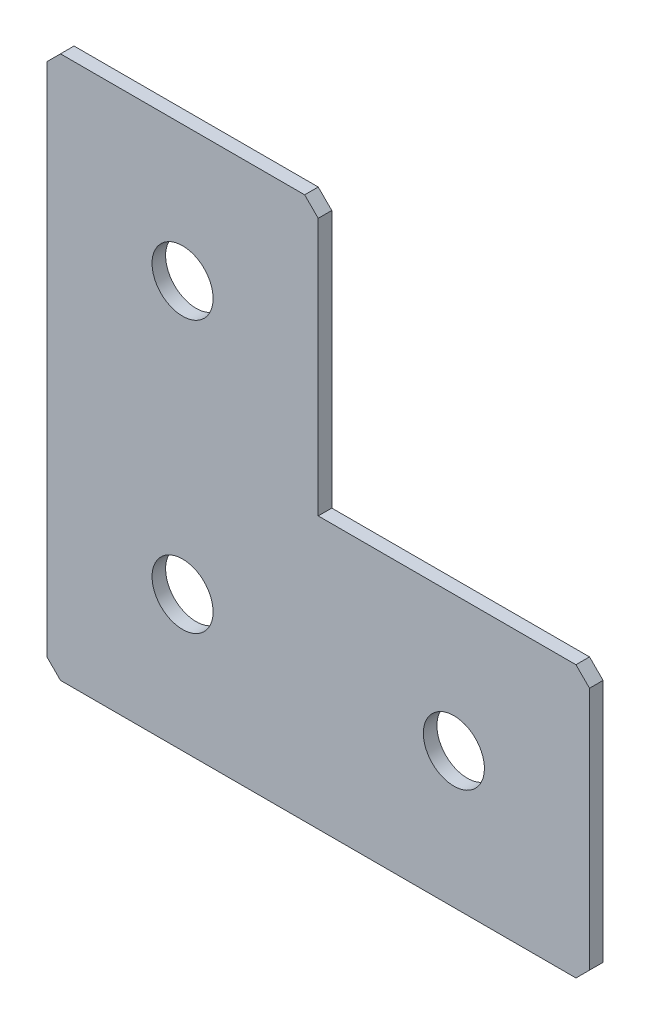
ISO-10303-21;
HEADER;
FILE_DESCRIPTION(('STEP AP214'),'2;1');
FILE_NAME('part.step','',(''),(''),'','','');
FILE_SCHEMA(('AUTOMOTIVE_DESIGN { 1 0 10303 214 1 1 1 1 }'));
ENDSEC;
DATA;
#1=APPLICATION_CONTEXT('core data for automotive mechanical design processes');
#2=APPLICATION_PROTOCOL_DEFINITION('international standard','automotive_design',2000,#1);
#3=PRODUCT_CONTEXT('',#1,'mechanical');
#4=PRODUCT('Part','Part','',(#3));
#5=PRODUCT_RELATED_PRODUCT_CATEGORY('part','',(#4));
#6=PRODUCT_DEFINITION_FORMATION('','',#4);
#7=PRODUCT_DEFINITION_CONTEXT('part definition',#1,'design');
#8=PRODUCT_DEFINITION('design','',#6,#7);
#9=PRODUCT_DEFINITION_SHAPE('','',#8);
#10=(LENGTH_UNIT() NAMED_UNIT(*) SI_UNIT(.MILLI.,.METRE.));
#11=(NAMED_UNIT(*) PLANE_ANGLE_UNIT() SI_UNIT($,.RADIAN.));
#12=(NAMED_UNIT(*) SI_UNIT($,.STERADIAN.) SOLID_ANGLE_UNIT());
#13=UNCERTAINTY_MEASURE_WITH_UNIT(LENGTH_MEASURE(1.E-05),#10,'distance_accuracy_value','');
#14=(GEOMETRIC_REPRESENTATION_CONTEXT(3) GLOBAL_UNCERTAINTY_ASSIGNED_CONTEXT((#13)) GLOBAL_UNIT_ASSIGNED_CONTEXT((#10,
#11,#12)) REPRESENTATION_CONTEXT('',''));
#15=CARTESIAN_POINT('',(0.,0.,0.));
#16=DIRECTION('',(0.,0.,1.));
#17=DIRECTION('',(1.,0.,0.));
#18=AXIS2_PLACEMENT_3D('',#15,#16,#17);
#19=CARTESIAN_POINT('',(40.,0.,-2.));
#20=DIRECTION('',(0.,-1.,0.));
#21=DIRECTION('',(1.,0.,0.));
#22=AXIS2_PLACEMENT_3D('',#19,#20,#21);
#23=PLANE('',#22);
#24=DIRECTION('',(1.,0.,0.));
#25=VECTOR('',#24,1.);
#26=CARTESIAN_POINT('',(40.,0.,-2.));
#27=LINE('',#26,#25);
#28=CARTESIAN_POINT('',(2.,0.,-2.));
#29=VERTEX_POINT('',#28);
#30=CARTESIAN_POINT('',(38.,0.,-2.));
#31=VERTEX_POINT('',#30);
#32=EDGE_CURVE('E133',#29,#31,#27,.T.);
#33=ORIENTED_EDGE('',*,*,#32,.F.);
#34=DIRECTION('',(0.,0.,1.));
#35=VECTOR('',#34,1.);
#36=CARTESIAN_POINT('',(2.,0.,-2.));
#37=LINE('',#36,#35);
#38=CARTESIAN_POINT('',(2.,0.,0.));
#39=VERTEX_POINT('',#38);
#40=EDGE_CURVE('E173',#29,#39,#37,.T.);
#41=ORIENTED_EDGE('',*,*,#40,.T.);
#42=DIRECTION('',(1.,0.,0.));
#43=VECTOR('',#42,1.);
#44=CARTESIAN_POINT('',(40.,0.,0.));
#45=LINE('',#44,#43);
#46=CARTESIAN_POINT('',(38.,0.,0.));
#47=VERTEX_POINT('',#46);
#48=EDGE_CURVE('E157',#39,#47,#45,.T.);
#49=ORIENTED_EDGE('',*,*,#48,.T.);
#50=DIRECTION('',(0.,0.,-1.));
#51=VECTOR('',#50,1.);
#52=CARTESIAN_POINT('',(38.,0.,-2.));
#53=LINE('',#52,#51);
#54=EDGE_CURVE('E143',#47,#31,#53,.T.);
#55=ORIENTED_EDGE('',*,*,#54,.T.);
#56=EDGE_LOOP('',(#33,#41,#49,#55));
#57=FACE_BOUND('',#56,.T.);
#58=ADVANCED_FACE('F37',(#57),#23,.F.);
#59=CARTESIAN_POINT('',(40.,-40.,-2.));
#60=DIRECTION('',(-1.,0.,0.));
#61=DIRECTION('',(0.,-1.,0.));
#62=AXIS2_PLACEMENT_3D('',#59,#60,#61);
#63=PLANE('',#62);
#64=DIRECTION('',(0.,-1.,0.));
#65=VECTOR('',#64,1.);
#66=CARTESIAN_POINT('',(40.,-40.,-2.));
#67=LINE('',#66,#65);
#68=CARTESIAN_POINT('',(40.,-2.00000000000003,-2.));
#69=VERTEX_POINT('',#68);
#70=CARTESIAN_POINT('',(40.,-40.,-2.));
#71=VERTEX_POINT('',#70);
#72=EDGE_CURVE('E120',#69,#71,#67,.T.);
#73=ORIENTED_EDGE('',*,*,#72,.F.);
#74=DIRECTION('',(0.,0.,1.));
#75=VECTOR('',#74,1.);
#76=CARTESIAN_POINT('',(40.,-2.00000000000003,-2.));
#77=LINE('',#76,#75);
#78=CARTESIAN_POINT('',(40.,-2.00000000000003,0.));
#79=VERTEX_POINT('',#78);
#80=EDGE_CURVE('E199',#69,#79,#77,.T.);
#81=ORIENTED_EDGE('',*,*,#80,.T.);
#82=DIRECTION('',(0.,-1.,0.));
#83=VECTOR('',#82,1.);
#84=CARTESIAN_POINT('',(40.,-40.,0.));
#85=LINE('',#84,#83);
#86=CARTESIAN_POINT('',(40.,-40.,0.));
#87=VERTEX_POINT('',#86);
#88=EDGE_CURVE('E139',#79,#87,#85,.T.);
#89=ORIENTED_EDGE('',*,*,#88,.T.);
#90=DIRECTION('',(0.,0.,1.));
#91=VECTOR('',#90,1.);
#92=CARTESIAN_POINT('',(40.,-40.,-2.));
#93=LINE('',#92,#91);
#94=EDGE_CURVE('E136',#71,#87,#93,.T.);
#95=ORIENTED_EDGE('',*,*,#94,.F.);
#96=EDGE_LOOP('',(#73,#81,#89,#95));
#97=FACE_BOUND('',#96,.T.);
#98=ADVANCED_FACE('F137',(#97),#63,.F.);
#99=CARTESIAN_POINT('',(80.,-40.,-2.));
#100=DIRECTION('',(0.,-1.,0.));
#101=DIRECTION('',(1.,0.,0.));
#102=AXIS2_PLACEMENT_3D('',#99,#100,#101);
#103=PLANE('',#102);
#104=DIRECTION('',(1.,0.,0.));
#105=VECTOR('',#104,1.);
#106=CARTESIAN_POINT('',(80.,-40.,0.));
#107=LINE('',#106,#105);
#108=CARTESIAN_POINT('',(78.,-40.,0.));
#109=VERTEX_POINT('',#108);
#110=EDGE_CURVE('E162',#87,#109,#107,.T.);
#111=ORIENTED_EDGE('',*,*,#110,.T.);
#112=DIRECTION('',(0.,0.,-1.));
#113=VECTOR('',#112,1.);
#114=CARTESIAN_POINT('',(78.,-40.,-2.));
#115=LINE('',#114,#113);
#116=CARTESIAN_POINT('',(78.,-40.,-2.));
#117=VERTEX_POINT('',#116);
#118=EDGE_CURVE('E148',#109,#117,#115,.T.);
#119=ORIENTED_EDGE('',*,*,#118,.T.);
#120=DIRECTION('',(1.,0.,0.));
#121=VECTOR('',#120,1.);
#122=CARTESIAN_POINT('',(80.,-40.,-2.));
#123=LINE('',#122,#121);
#124=EDGE_CURVE('E125',#71,#117,#123,.T.);
#125=ORIENTED_EDGE('',*,*,#124,.F.);
#126=ORIENTED_EDGE('',*,*,#94,.T.);
#127=EDGE_LOOP('',(#111,#119,#125,#126));
#128=FACE_BOUND('',#127,.T.);
#129=ADVANCED_FACE('F146',(#128),#103,.F.);
#130=CARTESIAN_POINT('',(80.,-80.,-2.));
#131=DIRECTION('',(-1.,0.,0.));
#132=DIRECTION('',(0.,0.,1.));
#133=AXIS2_PLACEMENT_3D('',#130,#131,#132);
#134=PLANE('',#133);
#135=DIRECTION('',(0.,-1.,0.));
#136=VECTOR('',#135,1.);
#137=CARTESIAN_POINT('',(80.,-80.,-2.));
#138=LINE('',#137,#136);
#139=CARTESIAN_POINT('',(80.,-42.,-2.));
#140=VERTEX_POINT('',#139);
#141=CARTESIAN_POINT('',(80.,-78.,-2.));
#142=VERTEX_POINT('',#141);
#143=EDGE_CURVE('E149',#140,#142,#138,.T.);
#144=ORIENTED_EDGE('',*,*,#143,.F.);
#145=DIRECTION('',(0.,0.,1.));
#146=VECTOR('',#145,1.);
#147=CARTESIAN_POINT('',(80.,-42.,-2.));
#148=LINE('',#147,#146);
#149=CARTESIAN_POINT('',(80.,-42.,0.));
#150=VERTEX_POINT('',#149);
#151=EDGE_CURVE('E203',#140,#150,#148,.T.);
#152=ORIENTED_EDGE('',*,*,#151,.T.);
#153=DIRECTION('',(0.,-1.,0.));
#154=VECTOR('',#153,1.);
#155=CARTESIAN_POINT('',(80.,-80.,0.));
#156=LINE('',#155,#154);
#157=CARTESIAN_POINT('',(80.,-78.,0.));
#158=VERTEX_POINT('',#157);
#159=EDGE_CURVE('E164',#150,#158,#156,.T.);
#160=ORIENTED_EDGE('',*,*,#159,.T.);
#161=DIRECTION('',(0.,0.,-1.));
#162=VECTOR('',#161,1.);
#163=CARTESIAN_POINT('',(80.,-78.,-2.));
#164=LINE('',#163,#162);
#165=EDGE_CURVE('E201',#158,#142,#164,.T.);
#166=ORIENTED_EDGE('',*,*,#165,.T.);
#167=EDGE_LOOP('',(#144,#152,#160,#166));
#168=FACE_BOUND('',#167,.T.);
#169=ADVANCED_FACE('F210',(#168),#134,.F.);
#170=CARTESIAN_POINT('',(0.,-80.,-2.));
#171=DIRECTION('',(0.,1.,0.));
#172=DIRECTION('',(0.,0.,1.));
#173=AXIS2_PLACEMENT_3D('',#170,#171,#172);
#174=PLANE('',#173);
#175=DIRECTION('',(-1.,0.,0.));
#176=VECTOR('',#175,1.);
#177=CARTESIAN_POINT('',(0.,-80.,-2.));
#178=LINE('',#177,#176);
#179=CARTESIAN_POINT('',(78.,-80.,-2.));
#180=VERTEX_POINT('',#179);
#181=CARTESIAN_POINT('',(2.00000000000002,-80.,-2.));
#182=VERTEX_POINT('',#181);
#183=EDGE_CURVE('E151',#180,#182,#178,.T.);
#184=ORIENTED_EDGE('',*,*,#183,.F.);
#185=DIRECTION('',(0.,0.,1.));
#186=VECTOR('',#185,1.);
#187=CARTESIAN_POINT('',(78.,-80.,-2.));
#188=LINE('',#187,#186);
#189=CARTESIAN_POINT('',(78.,-80.,0.));
#190=VERTEX_POINT('',#189);
#191=EDGE_CURVE('E11',#180,#190,#188,.T.);
#192=ORIENTED_EDGE('',*,*,#191,.T.);
#193=DIRECTION('',(-1.,0.,0.));
#194=VECTOR('',#193,1.);
#195=CARTESIAN_POINT('',(0.,-80.,0.));
#196=LINE('',#195,#194);
#197=CARTESIAN_POINT('',(2.00000000000002,-80.,0.));
#198=VERTEX_POINT('',#197);
#199=EDGE_CURVE('E167',#190,#198,#196,.T.);
#200=ORIENTED_EDGE('',*,*,#199,.T.);
#201=DIRECTION('',(0.,0.,-1.));
#202=VECTOR('',#201,1.);
#203=CARTESIAN_POINT('',(2.00000000000002,-80.,-2.));
#204=LINE('',#203,#202);
#205=EDGE_CURVE('E45',#198,#182,#204,.T.);
#206=ORIENTED_EDGE('',*,*,#205,.T.);
#207=EDGE_LOOP('',(#184,#192,#200,#206));
#208=FACE_BOUND('',#207,.T.);
#209=ADVANCED_FACE('F220',(#208),#174,.F.);
#210=CARTESIAN_POINT('',(0.,0.,-2.));
#211=DIRECTION('',(1.,0.,0.));
#212=DIRECTION('',(0.,0.,-1.));
#213=AXIS2_PLACEMENT_3D('',#210,#211,#212);
#214=PLANE('',#213);
#215=DIRECTION('',(0.,1.,0.));
#216=VECTOR('',#215,1.);
#217=CARTESIAN_POINT('',(0.,0.,0.));
#218=LINE('',#217,#216);
#219=CARTESIAN_POINT('',(0.,-78.,0.));
#220=VERTEX_POINT('',#219);
#221=CARTESIAN_POINT('',(0.,-2.00000000000002,0.));
#222=VERTEX_POINT('',#221);
#223=EDGE_CURVE('E169',#220,#222,#218,.T.);
#224=ORIENTED_EDGE('',*,*,#223,.T.);
#225=DIRECTION('',(0.,0.,-1.));
#226=VECTOR('',#225,1.);
#227=CARTESIAN_POINT('',(0.,-2.00000000000002,-2.));
#228=LINE('',#227,#226);
#229=CARTESIAN_POINT('',(0.,-2.00000000000002,-2.));
#230=VERTEX_POINT('',#229);
#231=EDGE_CURVE('E189',#222,#230,#228,.T.);
#232=ORIENTED_EDGE('',*,*,#231,.T.);
#233=DIRECTION('',(0.,1.,0.));
#234=VECTOR('',#233,1.);
#235=CARTESIAN_POINT('',(0.,0.,-2.));
#236=LINE('',#235,#234);
#237=CARTESIAN_POINT('',(0.,-78.,-2.));
#238=VERTEX_POINT('',#237);
#239=EDGE_CURVE('E144',#238,#230,#236,.T.);
#240=ORIENTED_EDGE('',*,*,#239,.F.);
#241=DIRECTION('',(0.,0.,1.));
#242=VECTOR('',#241,1.);
#243=CARTESIAN_POINT('',(0.,-78.,-2.));
#244=LINE('',#243,#242);
#245=EDGE_CURVE('E186',#238,#220,#244,.T.);
#246=ORIENTED_EDGE('',*,*,#245,.T.);
#247=EDGE_LOOP('',(#224,#232,#240,#246));
#248=FACE_BOUND('',#247,.T.);
#249=ADVANCED_FACE('F227',(#248),#214,.F.);
#250=CARTESIAN_POINT('',(0.,0.,-2.));
#251=DIRECTION('',(0.,0.,1.));
#252=DIRECTION('',(1.,0.,0.));
#253=AXIS2_PLACEMENT_3D('',#250,#251,#252);
#254=PLANE('',#253);
#255=CARTESIAN_POINT('',(20.,-60.,-2.));
#256=DIRECTION('',(0.,0.,-1.));
#257=DIRECTION('',(0.,1.,0.));
#258=AXIS2_PLACEMENT_3D('',#255,#256,#257);
#259=CIRCLE('',#258,4.5);
#260=CARTESIAN_POINT('',(20.,-55.5,-2.));
#261=VERTEX_POINT('',#260);
#262=EDGE_CURVE('E251',#261,#261,#259,.T.);
#263=ORIENTED_EDGE('',*,*,#262,.F.);
#264=EDGE_LOOP('',(#263));
#265=FACE_BOUND('',#264,.T.);
#266=CARTESIAN_POINT('',(20.,-20.,-2.));
#267=DIRECTION('',(0.,0.,-1.));
#268=DIRECTION('',(0.,1.,0.));
#269=AXIS2_PLACEMENT_3D('',#266,#267,#268);
#270=CIRCLE('',#269,4.5);
#271=CARTESIAN_POINT('',(20.,-15.5,-2.));
#272=VERTEX_POINT('',#271);
#273=EDGE_CURVE('E245',#272,#272,#270,.T.);
#274=ORIENTED_EDGE('',*,*,#273,.F.);
#275=EDGE_LOOP('',(#274));
#276=FACE_BOUND('',#275,.T.);
#277=CARTESIAN_POINT('',(60.,-60.,-2.));
#278=DIRECTION('',(0.,0.,-1.));
#279=DIRECTION('',(0.,1.,0.));
#280=AXIS2_PLACEMENT_3D('',#277,#278,#279);
#281=CIRCLE('',#280,4.5);
#282=CARTESIAN_POINT('',(60.,-55.5,-2.));
#283=VERTEX_POINT('',#282);
#284=EDGE_CURVE('E239',#283,#283,#281,.T.);
#285=ORIENTED_EDGE('',*,*,#284,.F.);
#286=EDGE_LOOP('',(#285));
#287=FACE_BOUND('',#286,.T.);
#288=ORIENTED_EDGE('',*,*,#239,.T.);
#289=DIRECTION('',(-0.707106781186545,-0.70710678118655,0.));
#290=VECTOR('',#289,1.);
#291=CARTESIAN_POINT('',(2.,0.,-2.));
#292=LINE('',#291,#290);
#293=EDGE_CURVE('E197',#230,#29,#292,.F.);
#294=ORIENTED_EDGE('',*,*,#293,.T.);
#295=ORIENTED_EDGE('',*,*,#32,.T.);
#296=DIRECTION('',(-0.707106781186548,0.707106781186547,0.));
#297=VECTOR('',#296,1.);
#298=CARTESIAN_POINT('',(40.,-2.00000000000003,-2.));
#299=LINE('',#298,#297);
#300=EDGE_CURVE('E129',#31,#69,#299,.F.);
#301=ORIENTED_EDGE('',*,*,#300,.T.);
#302=ORIENTED_EDGE('',*,*,#72,.T.);
#303=ORIENTED_EDGE('',*,*,#124,.T.);
#304=DIRECTION('',(-0.70710678118655,0.707106781186545,0.));
#305=VECTOR('',#304,1.);
#306=CARTESIAN_POINT('',(80.,-42.,-2.));
#307=LINE('',#306,#305);
#308=EDGE_CURVE('E194',#117,#140,#307,.F.);
#309=ORIENTED_EDGE('',*,*,#308,.T.);
#310=ORIENTED_EDGE('',*,*,#143,.T.);
#311=DIRECTION('',(0.707106781186545,0.70710678118655,0.));
#312=VECTOR('',#311,1.);
#313=CARTESIAN_POINT('',(78.,-80.,-2.));
#314=LINE('',#313,#312);
#315=EDGE_CURVE('E58',#142,#180,#314,.F.);
#316=ORIENTED_EDGE('',*,*,#315,.T.);
#317=ORIENTED_EDGE('',*,*,#183,.T.);
#318=DIRECTION('',(0.70710678118655,-0.707106781186545,0.));
#319=VECTOR('',#318,1.);
#320=CARTESIAN_POINT('',(0.,-78.,-2.));
#321=LINE('',#320,#319);
#322=EDGE_CURVE('E191',#182,#238,#321,.F.);
#323=ORIENTED_EDGE('',*,*,#322,.T.);
#324=EDGE_LOOP('',(#288,#294,#295,#301,#302,#303,#309,#310,#316,#317,#323));
#325=FACE_BOUND('',#324,.T.);
#326=ADVANCED_FACE('F123',(#265,#276,#287,#325),#254,.F.);
#327=CARTESIAN_POINT('',(0.,0.,0.));
#328=DIRECTION('',(0.,0.,1.));
#329=DIRECTION('',(1.,0.,0.));
#330=AXIS2_PLACEMENT_3D('',#327,#328,#329);
#331=PLANE('',#330);
#332=CARTESIAN_POINT('',(20.,-60.,0.));
#333=DIRECTION('',(0.,0.,-1.));
#334=DIRECTION('',(0.,1.,0.));
#335=AXIS2_PLACEMENT_3D('',#332,#333,#334);
#336=CIRCLE('',#335,4.5);
#337=CARTESIAN_POINT('',(20.,-55.5,0.));
#338=VERTEX_POINT('',#337);
#339=EDGE_CURVE('E248',#338,#338,#336,.T.);
#340=ORIENTED_EDGE('',*,*,#339,.T.);
#341=EDGE_LOOP('',(#340));
#342=FACE_BOUND('',#341,.T.);
#343=CARTESIAN_POINT('',(20.,-20.,0.));
#344=DIRECTION('',(0.,0.,-1.));
#345=DIRECTION('',(0.,1.,0.));
#346=AXIS2_PLACEMENT_3D('',#343,#344,#345);
#347=CIRCLE('',#346,4.5);
#348=CARTESIAN_POINT('',(20.,-15.5,0.));
#349=VERTEX_POINT('',#348);
#350=EDGE_CURVE('E242',#349,#349,#347,.T.);
#351=ORIENTED_EDGE('',*,*,#350,.T.);
#352=EDGE_LOOP('',(#351));
#353=FACE_BOUND('',#352,.T.);
#354=CARTESIAN_POINT('',(60.,-60.,0.));
#355=DIRECTION('',(0.,0.,-1.));
#356=DIRECTION('',(0.,1.,0.));
#357=AXIS2_PLACEMENT_3D('',#354,#355,#356);
#358=CIRCLE('',#357,4.5);
#359=CARTESIAN_POINT('',(60.,-55.5,0.));
#360=VERTEX_POINT('',#359);
#361=EDGE_CURVE('E160',#360,#360,#358,.T.);
#362=ORIENTED_EDGE('',*,*,#361,.T.);
#363=EDGE_LOOP('',(#362));
#364=FACE_BOUND('',#363,.T.);
#365=ORIENTED_EDGE('',*,*,#48,.F.);
#366=DIRECTION('',(0.707106781186545,0.70710678118655,0.));
#367=VECTOR('',#366,1.);
#368=CARTESIAN_POINT('',(1.00000000000001,-1.,0.));
#369=LINE('',#368,#367);
#370=EDGE_CURVE('E184',#39,#222,#369,.F.);
#371=ORIENTED_EDGE('',*,*,#370,.T.);
#372=ORIENTED_EDGE('',*,*,#223,.F.);
#373=DIRECTION('',(-0.70710678118655,0.707106781186545,0.));
#374=VECTOR('',#373,1.);
#375=CARTESIAN_POINT('',(-39.,-39.0000000000003,0.));
#376=LINE('',#375,#374);
#377=EDGE_CURVE('E176',#220,#198,#376,.F.);
#378=ORIENTED_EDGE('',*,*,#377,.T.);
#379=ORIENTED_EDGE('',*,*,#199,.F.);
#380=DIRECTION('',(-0.707106781186545,-0.70710678118655,0.));
#381=VECTOR('',#380,1.);
#382=CARTESIAN_POINT('',(79.0000000000003,-78.9999999999997,0.));
#383=LINE('',#382,#381);
#384=EDGE_CURVE('E178',#190,#158,#383,.F.);
#385=ORIENTED_EDGE('',*,*,#384,.T.);
#386=ORIENTED_EDGE('',*,*,#159,.F.);
#387=DIRECTION('',(0.70710678118655,-0.707106781186545,0.));
#388=VECTOR('',#387,1.);
#389=CARTESIAN_POINT('',(18.9999999999997,18.9999999999998,0.));
#390=LINE('',#389,#388);
#391=EDGE_CURVE('E180',#150,#109,#390,.F.);
#392=ORIENTED_EDGE('',*,*,#391,.T.);
#393=ORIENTED_EDGE('',*,*,#110,.F.);
#394=ORIENTED_EDGE('',*,*,#88,.F.);
#395=DIRECTION('',(0.707106781186548,-0.707106781186547,0.));
#396=VECTOR('',#395,1.);
#397=CARTESIAN_POINT('',(19.,19.,0.));
#398=LINE('',#397,#396);
#399=EDGE_CURVE('E182',#79,#47,#398,.F.);
#400=ORIENTED_EDGE('',*,*,#399,.T.);
#401=EDGE_LOOP('',(#365,#371,#372,#378,#379,#385,#386,#392,#393,#394,#400));
#402=FACE_BOUND('',#401,.T.);
#403=ADVANCED_FACE('F215',(#342,#353,#364,#402),#331,.T.);
#404=CARTESIAN_POINT('',(60.,-60.,-2.));
#405=DIRECTION('',(0.,0.,-1.));
#406=DIRECTION('',(0.,1.,0.));
#407=AXIS2_PLACEMENT_3D('',#404,#405,#406);
#408=CYLINDRICAL_SURFACE('',#407,4.5);
#409=ORIENTED_EDGE('',*,*,#361,.F.);
#410=EDGE_LOOP('',(#409));
#411=FACE_BOUND('',#410,.T.);
#412=ORIENTED_EDGE('',*,*,#284,.T.);
#413=EDGE_LOOP('',(#412));
#414=FACE_BOUND('',#413,.T.);
#415=ADVANCED_FACE('F264',(#411,#414),#408,.F.);
#416=CARTESIAN_POINT('',(20.,-20.,-2.));
#417=DIRECTION('',(0.,0.,-1.));
#418=DIRECTION('',(0.,1.,0.));
#419=AXIS2_PLACEMENT_3D('',#416,#417,#418);
#420=CYLINDRICAL_SURFACE('',#419,4.5);
#421=ORIENTED_EDGE('',*,*,#350,.F.);
#422=EDGE_LOOP('',(#421));
#423=FACE_BOUND('',#422,.T.);
#424=ORIENTED_EDGE('',*,*,#273,.T.);
#425=EDGE_LOOP('',(#424));
#426=FACE_BOUND('',#425,.T.);
#427=ADVANCED_FACE('F266',(#423,#426),#420,.F.);
#428=CARTESIAN_POINT('',(20.,-60.,-2.));
#429=DIRECTION('',(0.,0.,-1.));
#430=DIRECTION('',(0.,1.,0.));
#431=AXIS2_PLACEMENT_3D('',#428,#429,#430);
#432=CYLINDRICAL_SURFACE('',#431,4.5);
#433=ORIENTED_EDGE('',*,*,#339,.F.);
#434=EDGE_LOOP('',(#433));
#435=FACE_BOUND('',#434,.T.);
#436=ORIENTED_EDGE('',*,*,#262,.T.);
#437=EDGE_LOOP('',(#436));
#438=FACE_BOUND('',#437,.T.);
#439=ADVANCED_FACE('F255',(#435,#438),#432,.F.);
#440=CARTESIAN_POINT('',(2.,0.,-2.));
#441=DIRECTION('',(0.70710678118655,-0.707106781186545,0.));
#442=DIRECTION('',(0.,0.,1.));
#443=AXIS2_PLACEMENT_3D('',#440,#441,#442);
#444=PLANE('',#443);
#445=ORIENTED_EDGE('',*,*,#293,.F.);
#446=ORIENTED_EDGE('',*,*,#231,.F.);
#447=ORIENTED_EDGE('',*,*,#370,.F.);
#448=ORIENTED_EDGE('',*,*,#40,.F.);
#449=EDGE_LOOP('',(#445,#446,#447,#448));
#450=FACE_BOUND('',#449,.T.);
#451=ADVANCED_FACE('F232',(#450),#444,.F.);
#452=CARTESIAN_POINT('',(40.,-2.00000000000003,-2.));
#453=DIRECTION('',(-0.707106781186547,-0.707106781186548,0.));
#454=DIRECTION('',(0.,0.,1.));
#455=AXIS2_PLACEMENT_3D('',#452,#453,#454);
#456=PLANE('',#455);
#457=ORIENTED_EDGE('',*,*,#300,.F.);
#458=ORIENTED_EDGE('',*,*,#54,.F.);
#459=ORIENTED_EDGE('',*,*,#399,.F.);
#460=ORIENTED_EDGE('',*,*,#80,.F.);
#461=EDGE_LOOP('',(#457,#458,#459,#460));
#462=FACE_BOUND('',#461,.T.);
#463=ADVANCED_FACE('F288',(#462),#456,.F.);
#464=CARTESIAN_POINT('',(80.,-42.,-2.));
#465=DIRECTION('',(-0.707106781186545,-0.70710678118655,0.));
#466=DIRECTION('',(0.,0.,1.));
#467=AXIS2_PLACEMENT_3D('',#464,#465,#466);
#468=PLANE('',#467);
#469=ORIENTED_EDGE('',*,*,#308,.F.);
#470=ORIENTED_EDGE('',*,*,#118,.F.);
#471=ORIENTED_EDGE('',*,*,#391,.F.);
#472=ORIENTED_EDGE('',*,*,#151,.F.);
#473=EDGE_LOOP('',(#469,#470,#471,#472));
#474=FACE_BOUND('',#473,.T.);
#475=ADVANCED_FACE('F291',(#474),#468,.F.);
#476=CARTESIAN_POINT('',(78.,-80.,-2.));
#477=DIRECTION('',(-0.70710678118655,0.707106781186545,0.));
#478=DIRECTION('',(0.,0.,1.));
#479=AXIS2_PLACEMENT_3D('',#476,#477,#478);
#480=PLANE('',#479);
#481=ORIENTED_EDGE('',*,*,#315,.F.);
#482=ORIENTED_EDGE('',*,*,#165,.F.);
#483=ORIENTED_EDGE('',*,*,#384,.F.);
#484=ORIENTED_EDGE('',*,*,#191,.F.);
#485=EDGE_LOOP('',(#481,#482,#483,#484));
#486=FACE_BOUND('',#485,.T.);
#487=ADVANCED_FACE('F219',(#486),#480,.F.);
#488=CARTESIAN_POINT('',(0.,-78.,-2.));
#489=DIRECTION('',(0.707106781186545,0.70710678118655,0.));
#490=DIRECTION('',(0.,0.,1.));
#491=AXIS2_PLACEMENT_3D('',#488,#489,#490);
#492=PLANE('',#491);
#493=ORIENTED_EDGE('',*,*,#322,.F.);
#494=ORIENTED_EDGE('',*,*,#205,.F.);
#495=ORIENTED_EDGE('',*,*,#377,.F.);
#496=ORIENTED_EDGE('',*,*,#245,.F.);
#497=EDGE_LOOP('',(#493,#494,#495,#496));
#498=FACE_BOUND('',#497,.T.);
#499=ADVANCED_FACE('F39',(#498),#492,.F.);
#500=CLOSED_SHELL('',(#58,#98,#129,#169,#209,#249,#326,#403,#415,#427,#439,#451,#463,#475,#487,#499));
#501=MANIFOLD_SOLID_BREP('B2',#500);
#502=ADVANCED_BREP_SHAPE_REPRESENTATION('',(#18,#501),#14);
#503=SHAPE_DEFINITION_REPRESENTATION(#9,#502);
ENDSEC;
END-ISO-10303-21;
